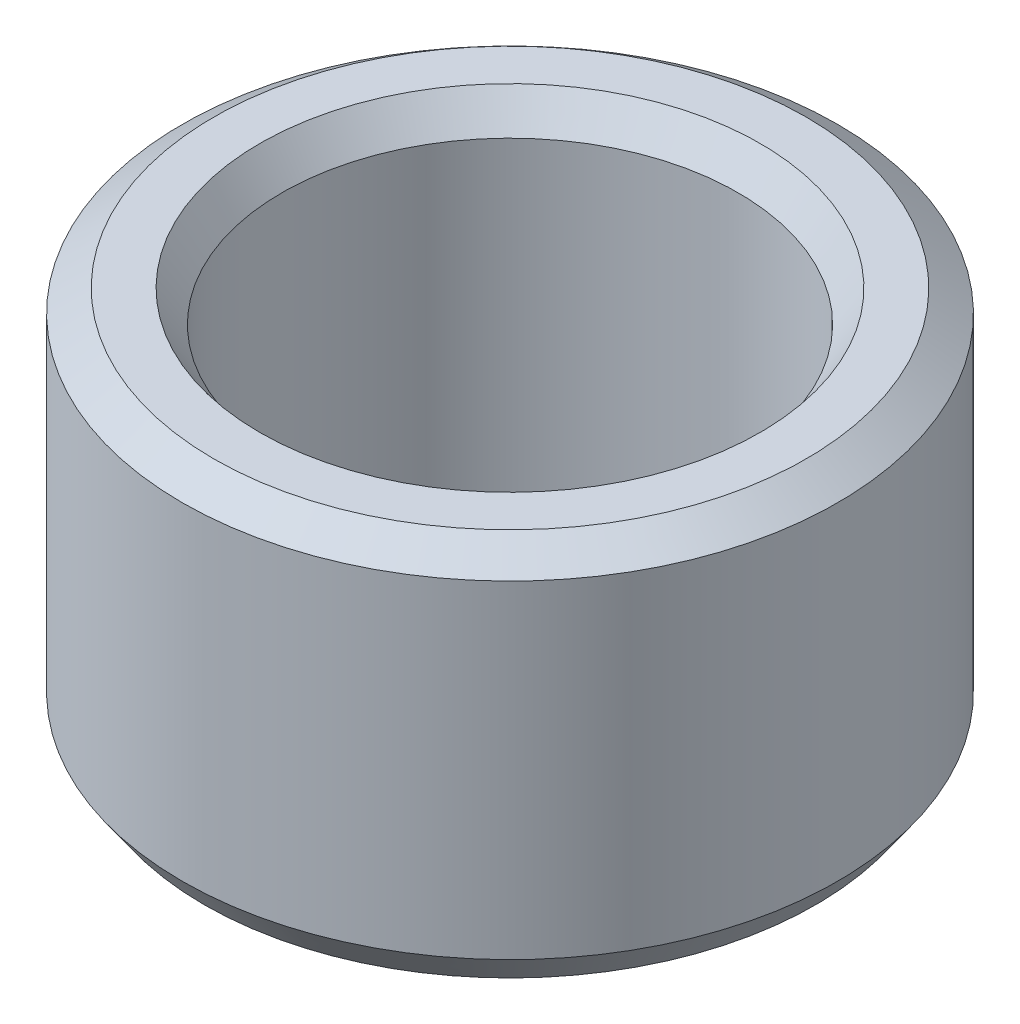
ISO-10303-21;
HEADER;
FILE_DESCRIPTION(('STEP AP214'),'2;1');
FILE_NAME('part.step','',(''),(''),'','','');
FILE_SCHEMA(('AUTOMOTIVE_DESIGN { 1 0 10303 214 1 1 1 1 }'));
ENDSEC;
DATA;
#1=APPLICATION_CONTEXT('core data for automotive mechanical design processes');
#2=APPLICATION_PROTOCOL_DEFINITION('international standard','automotive_design',2000,#1);
#3=PRODUCT_CONTEXT('',#1,'mechanical');
#4=PRODUCT('Part','Part','',(#3));
#5=PRODUCT_RELATED_PRODUCT_CATEGORY('part','',(#4));
#6=PRODUCT_DEFINITION_FORMATION('','',#4);
#7=PRODUCT_DEFINITION_CONTEXT('part definition',#1,'design');
#8=PRODUCT_DEFINITION('design','',#6,#7);
#9=PRODUCT_DEFINITION_SHAPE('','',#8);
#10=(LENGTH_UNIT() NAMED_UNIT(*) SI_UNIT(.MILLI.,.METRE.));
#11=(NAMED_UNIT(*) PLANE_ANGLE_UNIT() SI_UNIT($,.RADIAN.));
#12=(NAMED_UNIT(*) SI_UNIT($,.STERADIAN.) SOLID_ANGLE_UNIT());
#13=UNCERTAINTY_MEASURE_WITH_UNIT(LENGTH_MEASURE(1.E-05),#10,'distance_accuracy_value','');
#14=(GEOMETRIC_REPRESENTATION_CONTEXT(3) GLOBAL_UNCERTAINTY_ASSIGNED_CONTEXT((#13)) GLOBAL_UNIT_ASSIGNED_CONTEXT((#10,
#11,#12)) REPRESENTATION_CONTEXT('',''));
#15=CARTESIAN_POINT('',(0.,0.,0.));
#16=DIRECTION('',(0.,0.,1.));
#17=DIRECTION('',(1.,0.,0.));
#18=AXIS2_PLACEMENT_3D('',#15,#16,#17);
#19=CARTESIAN_POINT('',(0.,64.032696040328,0.));
#20=DIRECTION('',(0.,-1.,0.));
#21=DIRECTION('',(0.,0.,-1.));
#22=AXIS2_PLACEMENT_3D('',#19,#20,#21);
#23=CYLINDRICAL_SURFACE('',#22,55.);
#24=CARTESIAN_POINT('',(0.,5.29724627815652,0.));
#25=DIRECTION('',(0.,1.,0.));
#26=DIRECTION('',(0.,0.,1.));
#27=AXIS2_PLACEMENT_3D('',#24,#25,#26);
#28=CIRCLE('',#27,55.);
#29=CARTESIAN_POINT('',(0.,5.29724627815652,55.));
#30=VERTEX_POINT('',#29);
#31=EDGE_CURVE('E10',#30,#30,#28,.T.);
#32=ORIENTED_EDGE('',*,*,#31,.T.);
#33=EDGE_LOOP('',(#32));
#34=FACE_BOUND('',#33,.T.);
#35=CARTESIAN_POINT('',(0.,60.3165123404606,0.));
#36=DIRECTION('',(0.,1.,0.));
#37=DIRECTION('',(0.,0.,1.));
#38=AXIS2_PLACEMENT_3D('',#35,#36,#37);
#39=CIRCLE('',#38,55.);
#40=CARTESIAN_POINT('',(0.,60.3165123404606,55.));
#41=VERTEX_POINT('',#40);
#42=EDGE_CURVE('E50',#41,#41,#39,.F.);
#43=ORIENTED_EDGE('',*,*,#42,.T.);
#44=EDGE_LOOP('',(#43));
#45=FACE_BOUND('',#44,.T.);
#46=ADVANCED_FACE('F39',(#34,#45),#23,.T.);
#47=CARTESIAN_POINT('',(0.,64.032696040328,0.));
#48=DIRECTION('',(0.,1.,0.));
#49=DIRECTION('',(0.,0.,1.));
#50=AXIS2_PLACEMENT_3D('',#47,#48,#49);
#51=PLANE('',#50);
#52=CARTESIAN_POINT('',(0.,64.032696040328,0.));
#53=DIRECTION('',(0.,1.,0.));
#54=DIRECTION('',(0.,0.,1.));
#55=AXIS2_PLACEMENT_3D('',#52,#53,#54);
#56=CIRCLE('',#55,42.0038535517848);
#57=CARTESIAN_POINT('',(0.,64.032696040328,42.0038535517848));
#58=VERTEX_POINT('',#57);
#59=EDGE_CURVE('E58',#58,#58,#56,.F.);
#60=ORIENTED_EDGE('',*,*,#59,.T.);
#61=EDGE_LOOP('',(#60));
#62=FACE_BOUND('',#61,.T.);
#63=CARTESIAN_POINT('',(0.,64.032696040328,0.));
#64=DIRECTION('',(0.,1.,0.));
#65=DIRECTION('',(0.,0.,1.));
#66=AXIS2_PLACEMENT_3D('',#63,#64,#65);
#67=CIRCLE('',#66,49.7027537218435);
#68=CARTESIAN_POINT('',(0.,64.032696040328,49.7027537218435));
#69=VERTEX_POINT('',#68);
#70=EDGE_CURVE('E61',#69,#69,#67,.T.);
#71=ORIENTED_EDGE('',*,*,#70,.T.);
#72=EDGE_LOOP('',(#71));
#73=FACE_BOUND('',#72,.T.);
#74=ADVANCED_FACE('F88',(#62,#73),#51,.T.);
#75=CARTESIAN_POINT('',(0.,0.,0.));
#76=DIRECTION('',(0.,1.,0.));
#77=DIRECTION('',(0.,0.,1.));
#78=AXIS2_PLACEMENT_3D('',#75,#76,#77);
#79=PLANE('',#78);
#80=CARTESIAN_POINT('',(0.,0.,0.));
#81=DIRECTION('',(0.,1.,0.));
#82=DIRECTION('',(0.,0.,1.));
#83=AXIS2_PLACEMENT_3D('',#80,#81,#82);
#84=CIRCLE('',#83,43.5849161300738);
#85=CARTESIAN_POINT('',(0.,0.,43.5849161300738));
#86=VERTEX_POINT('',#85);
#87=EDGE_CURVE('E51',#86,#86,#84,.T.);
#88=ORIENTED_EDGE('',*,*,#87,.T.);
#89=EDGE_LOOP('',(#88));
#90=FACE_BOUND('',#89,.T.);
#91=CARTESIAN_POINT('',(0.,0.,0.));
#92=DIRECTION('',(0.,1.,0.));
#93=DIRECTION('',(0.,0.,1.));
#94=AXIS2_PLACEMENT_3D('',#91,#92,#93);
#95=CIRCLE('',#94,51.2838163001326);
#96=CARTESIAN_POINT('',(0.,0.,51.2838163001326));
#97=VERTEX_POINT('',#96);
#98=EDGE_CURVE('E54',#97,#97,#95,.F.);
#99=ORIENTED_EDGE('',*,*,#98,.T.);
#100=EDGE_LOOP('',(#99));
#101=FACE_BOUND('',#100,.T.);
#102=ADVANCED_FACE('F83',(#90,#101),#79,.F.);
#103=CARTESIAN_POINT('',(0.,64.032696040328,0.));
#104=DIRECTION('',(0.,-1.,0.));
#105=DIRECTION('',(0.,0.,-1.));
#106=AXIS2_PLACEMENT_3D('',#103,#104,#105);
#107=CYLINDRICAL_SURFACE('',#106,38.2876698519173);
#108=CARTESIAN_POINT('',(0.,58.7354497621715,0.));
#109=DIRECTION('',(0.,1.,0.));
#110=DIRECTION('',(0.,0.,1.));
#111=AXIS2_PLACEMENT_3D('',#108,#109,#110);
#112=CIRCLE('',#111,38.2876698519173);
#113=CARTESIAN_POINT('',(0.,58.7354497621715,38.2876698519173));
#114=VERTEX_POINT('',#113);
#115=EDGE_CURVE('E67',#114,#114,#112,.T.);
#116=ORIENTED_EDGE('',*,*,#115,.T.);
#117=EDGE_LOOP('',(#116));
#118=FACE_BOUND('',#117,.T.);
#119=CARTESIAN_POINT('',(0.,3.71618369986743,0.));
#120=DIRECTION('',(0.,1.,0.));
#121=DIRECTION('',(0.,0.,1.));
#122=AXIS2_PLACEMENT_3D('',#119,#120,#121);
#123=CIRCLE('',#122,38.2876698519173);
#124=CARTESIAN_POINT('',(0.,3.71618369986743,38.2876698519173));
#125=VERTEX_POINT('',#124);
#126=EDGE_CURVE('E69',#125,#125,#123,.F.);
#127=ORIENTED_EDGE('',*,*,#126,.T.);
#128=EDGE_LOOP('',(#127));
#129=FACE_BOUND('',#128,.T.);
#130=ADVANCED_FACE('F71',(#118,#129),#107,.F.);
#131=CARTESIAN_POINT('',(0.,58.7354497621715,0.));
#132=DIRECTION('',(0.,1.,0.));
#133=DIRECTION('',(0.,0.,1.));
#134=AXIS2_PLACEMENT_3D('',#131,#132,#133);
#135=CONICAL_SURFACE('',#134,38.2876698519173,0.611752896771567);
#136=ORIENTED_EDGE('',*,*,#59,.F.);
#137=EDGE_LOOP('',(#136));
#138=FACE_BOUND('',#137,.T.);
#139=ORIENTED_EDGE('',*,*,#115,.F.);
#140=EDGE_LOOP('',(#139));
#141=FACE_BOUND('',#140,.T.);
#142=ADVANCED_FACE('F77',(#138,#141),#135,.F.);
#143=CARTESIAN_POINT('',(0.,0.,0.));
#144=DIRECTION('',(0.,-1.,0.));
#145=DIRECTION('',(0.,0.,-1.));
#146=AXIS2_PLACEMENT_3D('',#143,#144,#145);
#147=CONICAL_SURFACE('',#146,43.5849161300738,0.959043430023329);
#148=ORIENTED_EDGE('',*,*,#126,.F.);
#149=EDGE_LOOP('',(#148));
#150=FACE_BOUND('',#149,.T.);
#151=ORIENTED_EDGE('',*,*,#87,.F.);
#152=EDGE_LOOP('',(#151));
#153=FACE_BOUND('',#152,.T.);
#154=ADVANCED_FACE('F73',(#150,#153),#147,.F.);
#155=CARTESIAN_POINT('',(0.,5.29724627815652,0.));
#156=DIRECTION('',(0.,1.,0.));
#157=DIRECTION('',(0.,0.,1.));
#158=AXIS2_PLACEMENT_3D('',#155,#156,#157);
#159=CONICAL_SURFACE('',#158,55.,0.61175289677157);
#160=ORIENTED_EDGE('',*,*,#98,.F.);
#161=EDGE_LOOP('',(#160));
#162=FACE_BOUND('',#161,.T.);
#163=ORIENTED_EDGE('',*,*,#31,.F.);
#164=EDGE_LOOP('',(#163));
#165=FACE_BOUND('',#164,.T.);
#166=ADVANCED_FACE('F76',(#162,#165),#159,.T.);
#167=CARTESIAN_POINT('',(0.,64.032696040328,0.));
#168=DIRECTION('',(0.,-1.,0.));
#169=DIRECTION('',(0.,0.,-1.));
#170=AXIS2_PLACEMENT_3D('',#167,#168,#169);
#171=CONICAL_SURFACE('',#170,49.7027537218435,0.959043430023328);
#172=ORIENTED_EDGE('',*,*,#42,.F.);
#173=EDGE_LOOP('',(#172));
#174=FACE_BOUND('',#173,.T.);
#175=ORIENTED_EDGE('',*,*,#70,.F.);
#176=EDGE_LOOP('',(#175));
#177=FACE_BOUND('',#176,.T.);
#178=ADVANCED_FACE('F45',(#174,#177),#171,.T.);
#179=CLOSED_SHELL('',(#46,#74,#102,#130,#142,#154,#166,#178));
#180=MANIFOLD_SOLID_BREP('B2',#179);
#181=ADVANCED_BREP_SHAPE_REPRESENTATION('',(#18,#180),#14);
#182=SHAPE_DEFINITION_REPRESENTATION(#9,#181);
ENDSEC;
END-ISO-10303-21;
